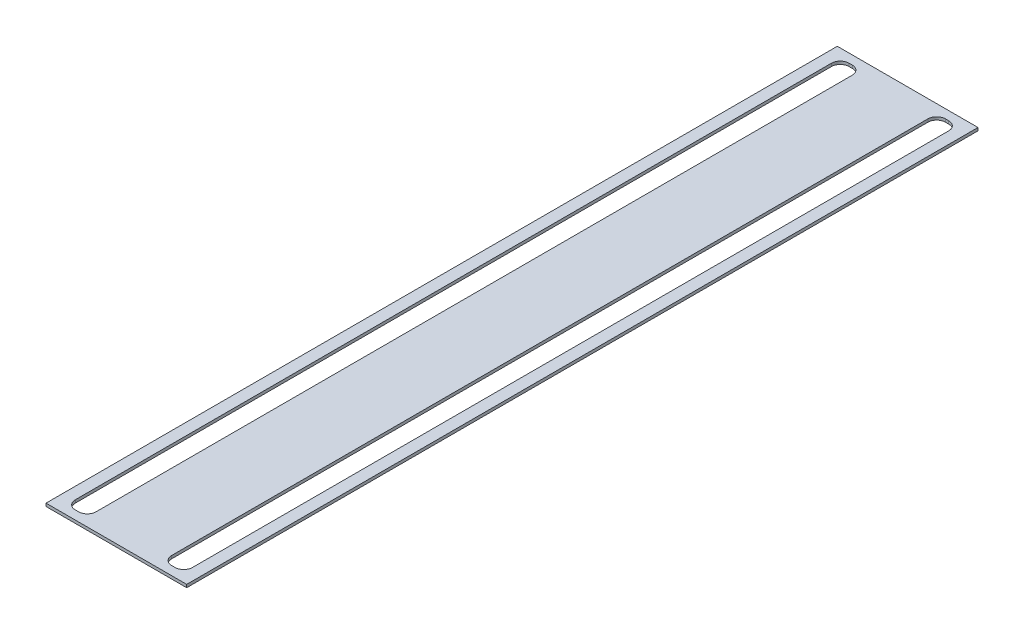
ISO-10303-21;
HEADER;
FILE_DESCRIPTION(('STEP AP214'),'2;1');
FILE_NAME('part.step','',(''),(''),'','','');
FILE_SCHEMA(('AUTOMOTIVE_DESIGN { 1 0 10303 214 1 1 1 1 }'));
ENDSEC;
DATA;
#1=APPLICATION_CONTEXT('core data for automotive mechanical design processes');
#2=APPLICATION_PROTOCOL_DEFINITION('international standard','automotive_design',2000,#1);
#3=PRODUCT_CONTEXT('',#1,'mechanical');
#4=PRODUCT('Part','Part','',(#3));
#5=PRODUCT_RELATED_PRODUCT_CATEGORY('part','',(#4));
#6=PRODUCT_DEFINITION_FORMATION('','',#4);
#7=PRODUCT_DEFINITION_CONTEXT('part definition',#1,'design');
#8=PRODUCT_DEFINITION('design','',#6,#7);
#9=PRODUCT_DEFINITION_SHAPE('','',#8);
#10=(LENGTH_UNIT() NAMED_UNIT(*) SI_UNIT(.MILLI.,.METRE.));
#11=(NAMED_UNIT(*) PLANE_ANGLE_UNIT() SI_UNIT($,.RADIAN.));
#12=(NAMED_UNIT(*) SI_UNIT($,.STERADIAN.) SOLID_ANGLE_UNIT());
#13=UNCERTAINTY_MEASURE_WITH_UNIT(LENGTH_MEASURE(1.E-05),#10,'distance_accuracy_value','');
#14=(GEOMETRIC_REPRESENTATION_CONTEXT(3) GLOBAL_UNCERTAINTY_ASSIGNED_CONTEXT((#13)) GLOBAL_UNIT_ASSIGNED_CONTEXT((#10,
#11,#12)) REPRESENTATION_CONTEXT('',''));
#15=CARTESIAN_POINT('',(0.,0.,0.));
#16=DIRECTION('',(0.,0.,1.));
#17=DIRECTION('',(1.,0.,0.));
#18=AXIS2_PLACEMENT_3D('',#15,#16,#17);
#19=CARTESIAN_POINT('',(0.,1.,0.));
#20=DIRECTION('',(0.,1.,0.));
#21=DIRECTION('',(0.,0.,1.));
#22=AXIS2_PLACEMENT_3D('',#19,#20,#21);
#23=PLANE('',#22);
#24=DIRECTION('',(0.,0.,1.));
#25=VECTOR('',#24,1.);
#26=CARTESIAN_POINT('',(-24.,1.,135.));
#27=LINE('',#26,#25);
#28=CARTESIAN_POINT('',(-24.,1.,-135.));
#29=VERTEX_POINT('',#28);
#30=CARTESIAN_POINT('',(-24.,1.,135.));
#31=VERTEX_POINT('',#30);
#32=EDGE_CURVE('E189',#29,#31,#27,.T.);
#33=ORIENTED_EDGE('',*,*,#32,.T.);
#34=DIRECTION('',(1.,0.,0.));
#35=VECTOR('',#34,1.);
#36=CARTESIAN_POINT('',(24.,1.,135.));
#37=LINE('',#36,#35);
#38=CARTESIAN_POINT('',(24.,1.,135.));
#39=VERTEX_POINT('',#38);
#40=EDGE_CURVE('E177',#31,#39,#37,.T.);
#41=ORIENTED_EDGE('',*,*,#40,.T.);
#42=DIRECTION('',(0.,0.,-1.));
#43=VECTOR('',#42,1.);
#44=CARTESIAN_POINT('',(24.,1.,135.));
#45=LINE('',#44,#43);
#46=CARTESIAN_POINT('',(24.,1.,-135.));
#47=VERTEX_POINT('',#46);
#48=EDGE_CURVE('E188',#39,#47,#45,.T.);
#49=ORIENTED_EDGE('',*,*,#48,.T.);
#50=DIRECTION('',(-1.,0.,0.));
#51=VECTOR('',#50,1.);
#52=CARTESIAN_POINT('',(24.,1.,-135.));
#53=LINE('',#52,#51);
#54=EDGE_CURVE('E193',#47,#29,#53,.T.);
#55=ORIENTED_EDGE('',*,*,#54,.T.);
#56=EDGE_LOOP('',(#33,#41,#49,#55));
#57=FACE_BOUND('',#56,.T.);
#58=DIRECTION('',(1.,0.,0.));
#59=VECTOR('',#58,1.);
#60=CARTESIAN_POINT('',(-20.,1.,132.));
#61=LINE('',#60,#59);
#62=CARTESIAN_POINT('',(-17.,1.,132.));
#63=VERTEX_POINT('',#62);
#64=CARTESIAN_POINT('',(-15.9,1.,132.));
#65=VERTEX_POINT('',#64);
#66=EDGE_CURVE('E364',#63,#65,#61,.T.);
#67=ORIENTED_EDGE('',*,*,#66,.F.);
#68=CARTESIAN_POINT('',(-17.,1.,129.));
#69=DIRECTION('',(0.,1.,0.));
#70=DIRECTION('',(0.,0.,1.));
#71=AXIS2_PLACEMENT_3D('',#68,#69,#70);
#72=CIRCLE('',#71,3.);
#73=CARTESIAN_POINT('',(-20.,1.,129.));
#74=VERTEX_POINT('',#73);
#75=EDGE_CURVE('E54',#63,#74,#72,.F.);
#76=ORIENTED_EDGE('',*,*,#75,.T.);
#77=DIRECTION('',(0.,0.,1.));
#78=VECTOR('',#77,1.);
#79=CARTESIAN_POINT('',(-20.,1.,-132.));
#80=LINE('',#79,#78);
#81=CARTESIAN_POINT('',(-20.,1.,-129.));
#82=VERTEX_POINT('',#81);
#83=EDGE_CURVE('E361',#82,#74,#80,.T.);
#84=ORIENTED_EDGE('',*,*,#83,.F.);
#85=CARTESIAN_POINT('',(-17.,1.,-129.));
#86=DIRECTION('',(0.,1.,0.));
#87=DIRECTION('',(0.,0.,1.));
#88=AXIS2_PLACEMENT_3D('',#85,#86,#87);
#89=CIRCLE('',#88,3.);
#90=CARTESIAN_POINT('',(-17.,1.,-132.));
#91=VERTEX_POINT('',#90);
#92=EDGE_CURVE('E300',#82,#91,#89,.F.);
#93=ORIENTED_EDGE('',*,*,#92,.T.);
#94=DIRECTION('',(-1.,0.,0.));
#95=VECTOR('',#94,1.);
#96=CARTESIAN_POINT('',(-20.,1.,-132.));
#97=LINE('',#96,#95);
#98=CARTESIAN_POINT('',(-15.9,1.,-132.));
#99=VERTEX_POINT('',#98);
#100=EDGE_CURVE('E373',#99,#91,#97,.T.);
#101=ORIENTED_EDGE('',*,*,#100,.F.);
#102=CARTESIAN_POINT('',(-15.9,1.,-129.));
#103=DIRECTION('',(0.,1.,0.));
#104=DIRECTION('',(0.,0.,1.));
#105=AXIS2_PLACEMENT_3D('',#102,#103,#104);
#106=CIRCLE('',#105,3.);
#107=CARTESIAN_POINT('',(-12.9,1.,-129.));
#108=VERTEX_POINT('',#107);
#109=EDGE_CURVE('E294',#99,#108,#106,.F.);
#110=ORIENTED_EDGE('',*,*,#109,.T.);
#111=DIRECTION('',(0.,0.,-1.));
#112=VECTOR('',#111,1.);
#113=CARTESIAN_POINT('',(-12.9,1.,-132.));
#114=LINE('',#113,#112);
#115=CARTESIAN_POINT('',(-12.9,1.,129.));
#116=VERTEX_POINT('',#115);
#117=EDGE_CURVE('E369',#116,#108,#114,.T.);
#118=ORIENTED_EDGE('',*,*,#117,.F.);
#119=CARTESIAN_POINT('',(-15.9,1.,129.));
#120=DIRECTION('',(0.,1.,0.));
#121=DIRECTION('',(0.,0.,1.));
#122=AXIS2_PLACEMENT_3D('',#119,#120,#121);
#123=CIRCLE('',#122,3.);
#124=EDGE_CURVE('E288',#116,#65,#123,.F.);
#125=ORIENTED_EDGE('',*,*,#124,.T.);
#126=EDGE_LOOP('',(#67,#76,#84,#93,#101,#110,#118,#125));
#127=FACE_BOUND('',#126,.T.);
#128=DIRECTION('',(-1.,0.,0.));
#129=VECTOR('',#128,1.);
#130=CARTESIAN_POINT('',(20.,1.,-132.));
#131=LINE('',#130,#129);
#132=CARTESIAN_POINT('',(17.,1.,-132.));
#133=VERTEX_POINT('',#132);
#134=CARTESIAN_POINT('',(15.9,1.,-132.));
#135=VERTEX_POINT('',#134);
#136=EDGE_CURVE('E336',#133,#135,#131,.T.);
#137=ORIENTED_EDGE('',*,*,#136,.F.);
#138=CARTESIAN_POINT('',(17.,1.,-129.));
#139=DIRECTION('',(0.,1.,0.));
#140=DIRECTION('',(0.,0.,1.));
#141=AXIS2_PLACEMENT_3D('',#138,#139,#140);
#142=CIRCLE('',#141,3.);
#143=CARTESIAN_POINT('',(20.,1.,-129.));
#144=VERTEX_POINT('',#143);
#145=EDGE_CURVE('E11',#133,#144,#142,.F.);
#146=ORIENTED_EDGE('',*,*,#145,.T.);
#147=DIRECTION('',(0.,0.,-1.));
#148=VECTOR('',#147,1.);
#149=CARTESIAN_POINT('',(20.,1.,-132.));
#150=LINE('',#149,#148);
#151=CARTESIAN_POINT('',(20.,1.,129.));
#152=VERTEX_POINT('',#151);
#153=EDGE_CURVE('E334',#152,#144,#150,.T.);
#154=ORIENTED_EDGE('',*,*,#153,.F.);
#155=CARTESIAN_POINT('',(17.,1.,129.));
#156=DIRECTION('',(0.,1.,0.));
#157=DIRECTION('',(0.,0.,1.));
#158=AXIS2_PLACEMENT_3D('',#155,#156,#157);
#159=CIRCLE('',#158,3.);
#160=CARTESIAN_POINT('',(17.,1.,132.));
#161=VERTEX_POINT('',#160);
#162=EDGE_CURVE('E282',#152,#161,#159,.F.);
#163=ORIENTED_EDGE('',*,*,#162,.T.);
#164=DIRECTION('',(1.,0.,0.));
#165=VECTOR('',#164,1.);
#166=CARTESIAN_POINT('',(20.,1.,132.));
#167=LINE('',#166,#165);
#168=CARTESIAN_POINT('',(15.9,1.,132.));
#169=VERTEX_POINT('',#168);
#170=EDGE_CURVE('E352',#169,#161,#167,.T.);
#171=ORIENTED_EDGE('',*,*,#170,.F.);
#172=CARTESIAN_POINT('',(15.9,1.,129.));
#173=DIRECTION('',(0.,1.,0.));
#174=DIRECTION('',(0.,0.,1.));
#175=AXIS2_PLACEMENT_3D('',#172,#173,#174);
#176=CIRCLE('',#175,3.);
#177=CARTESIAN_POINT('',(12.9,1.,129.));
#178=VERTEX_POINT('',#177);
#179=EDGE_CURVE('E276',#169,#178,#176,.F.);
#180=ORIENTED_EDGE('',*,*,#179,.T.);
#181=DIRECTION('',(0.,0.,1.));
#182=VECTOR('',#181,1.);
#183=CARTESIAN_POINT('',(12.9,1.,-132.));
#184=LINE('',#183,#182);
#185=CARTESIAN_POINT('',(12.9,1.,-129.));
#186=VERTEX_POINT('',#185);
#187=EDGE_CURVE('E344',#186,#178,#184,.T.);
#188=ORIENTED_EDGE('',*,*,#187,.F.);
#189=CARTESIAN_POINT('',(15.9,1.,-129.));
#190=DIRECTION('',(0.,1.,0.));
#191=DIRECTION('',(0.,0.,1.));
#192=AXIS2_PLACEMENT_3D('',#189,#190,#191);
#193=CIRCLE('',#192,3.);
#194=EDGE_CURVE('E270',#186,#135,#193,.F.);
#195=ORIENTED_EDGE('',*,*,#194,.T.);
#196=EDGE_LOOP('',(#137,#146,#154,#163,#171,#180,#188,#195));
#197=FACE_BOUND('',#196,.T.);
#198=ADVANCED_FACE('F38',(#57,#127,#197),#23,.T.);
#199=CARTESIAN_POINT('',(0.,0.,0.));
#200=DIRECTION('',(0.,1.,0.));
#201=DIRECTION('',(0.,0.,1.));
#202=AXIS2_PLACEMENT_3D('',#199,#200,#201);
#203=PLANE('',#202);
#204=DIRECTION('',(-1.,0.,0.));
#205=VECTOR('',#204,1.);
#206=CARTESIAN_POINT('',(-20.,0.,-132.));
#207=LINE('',#206,#205);
#208=CARTESIAN_POINT('',(-15.9,0.,-132.));
#209=VERTEX_POINT('',#208);
#210=CARTESIAN_POINT('',(-17.,0.,-132.));
#211=VERTEX_POINT('',#210);
#212=EDGE_CURVE('E365',#209,#211,#207,.T.);
#213=ORIENTED_EDGE('',*,*,#212,.T.);
#214=CARTESIAN_POINT('',(-17.,0.,-129.));
#215=DIRECTION('',(0.,1.,0.));
#216=DIRECTION('',(0.,0.,1.));
#217=AXIS2_PLACEMENT_3D('',#214,#215,#216);
#218=CIRCLE('',#217,3.);
#219=CARTESIAN_POINT('',(-20.,0.,-129.));
#220=VERTEX_POINT('',#219);
#221=EDGE_CURVE('E297',#211,#220,#218,.T.);
#222=ORIENTED_EDGE('',*,*,#221,.T.);
#223=DIRECTION('',(0.,0.,1.));
#224=VECTOR('',#223,1.);
#225=CARTESIAN_POINT('',(-20.,0.,-132.));
#226=LINE('',#225,#224);
#227=CARTESIAN_POINT('',(-20.,0.,129.));
#228=VERTEX_POINT('',#227);
#229=EDGE_CURVE('E356',#220,#228,#226,.T.);
#230=ORIENTED_EDGE('',*,*,#229,.T.);
#231=CARTESIAN_POINT('',(-17.,0.,129.));
#232=DIRECTION('',(0.,1.,0.));
#233=DIRECTION('',(0.,0.,1.));
#234=AXIS2_PLACEMENT_3D('',#231,#232,#233);
#235=CIRCLE('',#234,3.);
#236=CARTESIAN_POINT('',(-17.,0.,132.));
#237=VERTEX_POINT('',#236);
#238=EDGE_CURVE('E303',#228,#237,#235,.T.);
#239=ORIENTED_EDGE('',*,*,#238,.T.);
#240=DIRECTION('',(1.,0.,0.));
#241=VECTOR('',#240,1.);
#242=CARTESIAN_POINT('',(-20.,0.,132.));
#243=LINE('',#242,#241);
#244=CARTESIAN_POINT('',(-15.9,0.,132.));
#245=VERTEX_POINT('',#244);
#246=EDGE_CURVE('E380',#237,#245,#243,.T.);
#247=ORIENTED_EDGE('',*,*,#246,.T.);
#248=CARTESIAN_POINT('',(-15.9,0.,129.));
#249=DIRECTION('',(0.,1.,0.));
#250=DIRECTION('',(0.,0.,1.));
#251=AXIS2_PLACEMENT_3D('',#248,#249,#250);
#252=CIRCLE('',#251,3.);
#253=CARTESIAN_POINT('',(-12.9,0.,129.));
#254=VERTEX_POINT('',#253);
#255=EDGE_CURVE('E285',#245,#254,#252,.T.);
#256=ORIENTED_EDGE('',*,*,#255,.T.);
#257=DIRECTION('',(0.,0.,-1.));
#258=VECTOR('',#257,1.);
#259=CARTESIAN_POINT('',(-12.9,0.,-132.));
#260=LINE('',#259,#258);
#261=CARTESIAN_POINT('',(-12.9,0.,-129.));
#262=VERTEX_POINT('',#261);
#263=EDGE_CURVE('E384',#254,#262,#260,.T.);
#264=ORIENTED_EDGE('',*,*,#263,.T.);
#265=CARTESIAN_POINT('',(-15.9,0.,-129.));
#266=DIRECTION('',(0.,1.,0.));
#267=DIRECTION('',(0.,0.,1.));
#268=AXIS2_PLACEMENT_3D('',#265,#266,#267);
#269=CIRCLE('',#268,3.);
#270=EDGE_CURVE('E291',#262,#209,#269,.T.);
#271=ORIENTED_EDGE('',*,*,#270,.T.);
#272=EDGE_LOOP('',(#213,#222,#230,#239,#247,#256,#264,#271));
#273=FACE_BOUND('',#272,.T.);
#274=DIRECTION('',(0.,0.,1.));
#275=VECTOR('',#274,1.);
#276=CARTESIAN_POINT('',(-24.,0.,135.));
#277=LINE('',#276,#275);
#278=CARTESIAN_POINT('',(-24.,0.,-135.));
#279=VERTEX_POINT('',#278);
#280=CARTESIAN_POINT('',(-24.,0.,135.));
#281=VERTEX_POINT('',#280);
#282=EDGE_CURVE('E202',#279,#281,#277,.T.);
#283=ORIENTED_EDGE('',*,*,#282,.F.);
#284=DIRECTION('',(-1.,0.,0.));
#285=VECTOR('',#284,1.);
#286=CARTESIAN_POINT('',(24.,0.,-135.));
#287=LINE('',#286,#285);
#288=CARTESIAN_POINT('',(24.,0.,-135.));
#289=VERTEX_POINT('',#288);
#290=EDGE_CURVE('E198',#289,#279,#287,.T.);
#291=ORIENTED_EDGE('',*,*,#290,.F.);
#292=DIRECTION('',(0.,0.,-1.));
#293=VECTOR('',#292,1.);
#294=CARTESIAN_POINT('',(24.,0.,135.));
#295=LINE('',#294,#293);
#296=CARTESIAN_POINT('',(24.,0.,135.));
#297=VERTEX_POINT('',#296);
#298=EDGE_CURVE('E400',#297,#289,#295,.T.);
#299=ORIENTED_EDGE('',*,*,#298,.F.);
#300=DIRECTION('',(1.,0.,0.));
#301=VECTOR('',#300,1.);
#302=CARTESIAN_POINT('',(24.,0.,135.));
#303=LINE('',#302,#301);
#304=EDGE_CURVE('E397',#281,#297,#303,.T.);
#305=ORIENTED_EDGE('',*,*,#304,.F.);
#306=EDGE_LOOP('',(#283,#291,#299,#305));
#307=FACE_BOUND('',#306,.T.);
#308=DIRECTION('',(1.,0.,0.));
#309=VECTOR('',#308,1.);
#310=CARTESIAN_POINT('',(20.,0.,132.));
#311=LINE('',#310,#309);
#312=CARTESIAN_POINT('',(15.9,0.,132.));
#313=VERTEX_POINT('',#312);
#314=CARTESIAN_POINT('',(17.,0.,132.));
#315=VERTEX_POINT('',#314);
#316=EDGE_CURVE('E341',#313,#315,#311,.T.);
#317=ORIENTED_EDGE('',*,*,#316,.T.);
#318=CARTESIAN_POINT('',(17.,0.,129.));
#319=DIRECTION('',(0.,1.,0.));
#320=DIRECTION('',(0.,0.,1.));
#321=AXIS2_PLACEMENT_3D('',#318,#319,#320);
#322=CIRCLE('',#321,3.);
#323=CARTESIAN_POINT('',(20.,0.,129.));
#324=VERTEX_POINT('',#323);
#325=EDGE_CURVE('E279',#315,#324,#322,.T.);
#326=ORIENTED_EDGE('',*,*,#325,.T.);
#327=DIRECTION('',(0.,0.,-1.));
#328=VECTOR('',#327,1.);
#329=CARTESIAN_POINT('',(20.,0.,-132.));
#330=LINE('',#329,#328);
#331=CARTESIAN_POINT('',(20.,0.,-129.));
#332=VERTEX_POINT('',#331);
#333=EDGE_CURVE('E318',#324,#332,#330,.T.);
#334=ORIENTED_EDGE('',*,*,#333,.T.);
#335=CARTESIAN_POINT('',(17.,0.,-129.));
#336=DIRECTION('',(0.,1.,0.));
#337=DIRECTION('',(0.,0.,1.));
#338=AXIS2_PLACEMENT_3D('',#335,#336,#337);
#339=CIRCLE('',#338,3.);
#340=CARTESIAN_POINT('',(17.,0.,-132.));
#341=VERTEX_POINT('',#340);
#342=EDGE_CURVE('E47',#332,#341,#339,.T.);
#343=ORIENTED_EDGE('',*,*,#342,.T.);
#344=DIRECTION('',(-1.,0.,0.));
#345=VECTOR('',#344,1.);
#346=CARTESIAN_POINT('',(20.,0.,-132.));
#347=LINE('',#346,#345);
#348=CARTESIAN_POINT('',(15.9,0.,-132.));
#349=VERTEX_POINT('',#348);
#350=EDGE_CURVE('E316',#341,#349,#347,.T.);
#351=ORIENTED_EDGE('',*,*,#350,.T.);
#352=CARTESIAN_POINT('',(15.9,0.,-129.));
#353=DIRECTION('',(0.,1.,0.));
#354=DIRECTION('',(0.,0.,1.));
#355=AXIS2_PLACEMENT_3D('',#352,#353,#354);
#356=CIRCLE('',#355,3.);
#357=CARTESIAN_POINT('',(12.9,0.,-129.));
#358=VERTEX_POINT('',#357);
#359=EDGE_CURVE('E267',#349,#358,#356,.T.);
#360=ORIENTED_EDGE('',*,*,#359,.T.);
#361=DIRECTION('',(0.,0.,1.));
#362=VECTOR('',#361,1.);
#363=CARTESIAN_POINT('',(12.9,0.,-132.));
#364=LINE('',#363,#362);
#365=CARTESIAN_POINT('',(12.9,0.,129.));
#366=VERTEX_POINT('',#365);
#367=EDGE_CURVE('E328',#358,#366,#364,.T.);
#368=ORIENTED_EDGE('',*,*,#367,.T.);
#369=CARTESIAN_POINT('',(15.9,0.,129.));
#370=DIRECTION('',(0.,1.,0.));
#371=DIRECTION('',(0.,0.,1.));
#372=AXIS2_PLACEMENT_3D('',#369,#370,#371);
#373=CIRCLE('',#372,3.);
#374=EDGE_CURVE('E273',#366,#313,#373,.T.);
#375=ORIENTED_EDGE('',*,*,#374,.T.);
#376=EDGE_LOOP('',(#317,#326,#334,#343,#351,#360,#368,#375));
#377=FACE_BOUND('',#376,.T.);
#378=ADVANCED_FACE('F315',(#273,#307,#377),#203,.F.);
#379=CARTESIAN_POINT('',(-24.,1.,135.));
#380=DIRECTION('',(1.,0.,0.));
#381=DIRECTION('',(0.,0.,-1.));
#382=AXIS2_PLACEMENT_3D('',#379,#380,#381);
#383=PLANE('',#382);
#384=ORIENTED_EDGE('',*,*,#282,.T.);
#385=DIRECTION('',(0.,-1.,0.));
#386=VECTOR('',#385,1.);
#387=CARTESIAN_POINT('',(-24.,1.,135.));
#388=LINE('',#387,#386);
#389=EDGE_CURVE('E181',#31,#281,#388,.T.);
#390=ORIENTED_EDGE('',*,*,#389,.F.);
#391=ORIENTED_EDGE('',*,*,#32,.F.);
#392=DIRECTION('',(0.,-1.,0.));
#393=VECTOR('',#392,1.);
#394=CARTESIAN_POINT('',(-24.,1.,-135.));
#395=LINE('',#394,#393);
#396=EDGE_CURVE('E394',#29,#279,#395,.T.);
#397=ORIENTED_EDGE('',*,*,#396,.T.);
#398=EDGE_LOOP('',(#384,#390,#391,#397));
#399=FACE_BOUND('',#398,.T.);
#400=ADVANCED_FACE('F200',(#399),#383,.F.);
#401=CARTESIAN_POINT('',(24.,1.,135.));
#402=DIRECTION('',(0.,0.,-1.));
#403=DIRECTION('',(-1.,0.,0.));
#404=AXIS2_PLACEMENT_3D('',#401,#402,#403);
#405=PLANE('',#404);
#406=ORIENTED_EDGE('',*,*,#304,.T.);
#407=DIRECTION('',(0.,-1.,0.));
#408=VECTOR('',#407,1.);
#409=CARTESIAN_POINT('',(24.,1.,135.));
#410=LINE('',#409,#408);
#411=EDGE_CURVE('E184',#39,#297,#410,.T.);
#412=ORIENTED_EDGE('',*,*,#411,.F.);
#413=ORIENTED_EDGE('',*,*,#40,.F.);
#414=ORIENTED_EDGE('',*,*,#389,.T.);
#415=EDGE_LOOP('',(#406,#412,#413,#414));
#416=FACE_BOUND('',#415,.T.);
#417=ADVANCED_FACE('F179',(#416),#405,.F.);
#418=CARTESIAN_POINT('',(24.,1.,135.));
#419=DIRECTION('',(-1.,0.,0.));
#420=DIRECTION('',(0.,0.,1.));
#421=AXIS2_PLACEMENT_3D('',#418,#419,#420);
#422=PLANE('',#421);
#423=ORIENTED_EDGE('',*,*,#298,.T.);
#424=DIRECTION('',(0.,-1.,0.));
#425=VECTOR('',#424,1.);
#426=CARTESIAN_POINT('',(24.,1.,-135.));
#427=LINE('',#426,#425);
#428=EDGE_CURVE('E212',#47,#289,#427,.T.);
#429=ORIENTED_EDGE('',*,*,#428,.F.);
#430=ORIENTED_EDGE('',*,*,#48,.F.);
#431=ORIENTED_EDGE('',*,*,#411,.T.);
#432=EDGE_LOOP('',(#423,#429,#430,#431));
#433=FACE_BOUND('',#432,.T.);
#434=ADVANCED_FACE('F413',(#433),#422,.F.);
#435=CARTESIAN_POINT('',(24.,1.,-135.));
#436=DIRECTION('',(0.,0.,1.));
#437=DIRECTION('',(1.,0.,0.));
#438=AXIS2_PLACEMENT_3D('',#435,#436,#437);
#439=PLANE('',#438);
#440=ORIENTED_EDGE('',*,*,#290,.T.);
#441=ORIENTED_EDGE('',*,*,#396,.F.);
#442=ORIENTED_EDGE('',*,*,#54,.F.);
#443=ORIENTED_EDGE('',*,*,#428,.T.);
#444=EDGE_LOOP('',(#440,#441,#442,#443));
#445=FACE_BOUND('',#444,.T.);
#446=ADVANCED_FACE('F409',(#445),#439,.F.);
#447=CARTESIAN_POINT('',(-20.,1.,-132.));
#448=DIRECTION('',(1.,0.,0.));
#449=DIRECTION('',(0.,0.,-1.));
#450=AXIS2_PLACEMENT_3D('',#447,#448,#449);
#451=PLANE('',#450);
#452=ORIENTED_EDGE('',*,*,#229,.F.);
#453=DIRECTION('',(0.,-1.,0.));
#454=VECTOR('',#453,1.);
#455=CARTESIAN_POINT('',(-20.,1.,-129.));
#456=LINE('',#455,#454);
#457=EDGE_CURVE('E61',#220,#82,#456,.F.);
#458=ORIENTED_EDGE('',*,*,#457,.T.);
#459=ORIENTED_EDGE('',*,*,#83,.T.);
#460=DIRECTION('',(0.,-1.,0.));
#461=VECTOR('',#460,1.);
#462=CARTESIAN_POINT('',(-20.,0.,129.));
#463=LINE('',#462,#461);
#464=EDGE_CURVE('E261',#74,#228,#463,.T.);
#465=ORIENTED_EDGE('',*,*,#464,.T.);
#466=EDGE_LOOP('',(#452,#458,#459,#465));
#467=FACE_BOUND('',#466,.T.);
#468=ADVANCED_FACE('F420',(#467),#451,.T.);
#469=CARTESIAN_POINT('',(-20.,1.,132.));
#470=DIRECTION('',(0.,0.,-1.));
#471=DIRECTION('',(-1.,0.,0.));
#472=AXIS2_PLACEMENT_3D('',#469,#470,#471);
#473=PLANE('',#472);
#474=ORIENTED_EDGE('',*,*,#66,.T.);
#475=DIRECTION('',(0.,-1.,0.));
#476=VECTOR('',#475,1.);
#477=CARTESIAN_POINT('',(-15.9,0.,132.));
#478=LINE('',#477,#476);
#479=EDGE_CURVE('E243',#65,#245,#478,.T.);
#480=ORIENTED_EDGE('',*,*,#479,.T.);
#481=ORIENTED_EDGE('',*,*,#246,.F.);
#482=DIRECTION('',(0.,-1.,0.));
#483=VECTOR('',#482,1.);
#484=CARTESIAN_POINT('',(-17.,1.,132.));
#485=LINE('',#484,#483);
#486=EDGE_CURVE('E240',#237,#63,#485,.F.);
#487=ORIENTED_EDGE('',*,*,#486,.T.);
#488=EDGE_LOOP('',(#474,#480,#481,#487));
#489=FACE_BOUND('',#488,.T.);
#490=ADVANCED_FACE('F433',(#489),#473,.T.);
#491=CARTESIAN_POINT('',(-12.9,1.,-132.));
#492=DIRECTION('',(-1.,0.,0.));
#493=DIRECTION('',(0.,0.,1.));
#494=AXIS2_PLACEMENT_3D('',#491,#492,#493);
#495=PLANE('',#494);
#496=ORIENTED_EDGE('',*,*,#263,.F.);
#497=DIRECTION('',(0.,-1.,0.));
#498=VECTOR('',#497,1.);
#499=CARTESIAN_POINT('',(-12.9,1.,129.));
#500=LINE('',#499,#498);
#501=EDGE_CURVE('E251',#254,#116,#500,.F.);
#502=ORIENTED_EDGE('',*,*,#501,.T.);
#503=ORIENTED_EDGE('',*,*,#117,.T.);
#504=DIRECTION('',(0.,-1.,0.));
#505=VECTOR('',#504,1.);
#506=CARTESIAN_POINT('',(-12.9,0.,-129.));
#507=LINE('',#506,#505);
#508=EDGE_CURVE('E247',#108,#262,#507,.T.);
#509=ORIENTED_EDGE('',*,*,#508,.T.);
#510=EDGE_LOOP('',(#496,#502,#503,#509));
#511=FACE_BOUND('',#510,.T.);
#512=ADVANCED_FACE('F436',(#511),#495,.T.);
#513=CARTESIAN_POINT('',(-20.,1.,-132.));
#514=DIRECTION('',(0.,0.,1.));
#515=DIRECTION('',(1.,0.,0.));
#516=AXIS2_PLACEMENT_3D('',#513,#514,#515);
#517=PLANE('',#516);
#518=ORIENTED_EDGE('',*,*,#212,.F.);
#519=DIRECTION('',(0.,-1.,0.));
#520=VECTOR('',#519,1.);
#521=CARTESIAN_POINT('',(-15.9,1.,-132.));
#522=LINE('',#521,#520);
#523=EDGE_CURVE('E258',#209,#99,#522,.F.);
#524=ORIENTED_EDGE('',*,*,#523,.T.);
#525=ORIENTED_EDGE('',*,*,#100,.T.);
#526=DIRECTION('',(0.,-1.,0.));
#527=VECTOR('',#526,1.);
#528=CARTESIAN_POINT('',(-17.,0.,-132.));
#529=LINE('',#528,#527);
#530=EDGE_CURVE('E254',#91,#211,#529,.T.);
#531=ORIENTED_EDGE('',*,*,#530,.T.);
#532=EDGE_LOOP('',(#518,#524,#525,#531));
#533=FACE_BOUND('',#532,.T.);
#534=ADVANCED_FACE('F440',(#533),#517,.T.);
#535=CARTESIAN_POINT('',(20.,1.,-132.));
#536=DIRECTION('',(-1.,0.,0.));
#537=DIRECTION('',(0.,0.,1.));
#538=AXIS2_PLACEMENT_3D('',#535,#536,#537);
#539=PLANE('',#538);
#540=ORIENTED_EDGE('',*,*,#333,.F.);
#541=DIRECTION('',(0.,-1.,0.));
#542=VECTOR('',#541,1.);
#543=CARTESIAN_POINT('',(20.,1.,129.));
#544=LINE('',#543,#542);
#545=EDGE_CURVE('E237',#324,#152,#544,.F.);
#546=ORIENTED_EDGE('',*,*,#545,.T.);
#547=ORIENTED_EDGE('',*,*,#153,.T.);
#548=DIRECTION('',(0.,-1.,0.));
#549=VECTOR('',#548,1.);
#550=CARTESIAN_POINT('',(20.,0.,-129.));
#551=LINE('',#550,#549);
#552=EDGE_CURVE('E233',#144,#332,#551,.T.);
#553=ORIENTED_EDGE('',*,*,#552,.T.);
#554=EDGE_LOOP('',(#540,#546,#547,#553));
#555=FACE_BOUND('',#554,.T.);
#556=ADVANCED_FACE('F338',(#555),#539,.T.);
#557=CARTESIAN_POINT('',(20.,1.,-132.));
#558=DIRECTION('',(0.,0.,1.));
#559=DIRECTION('',(1.,0.,0.));
#560=AXIS2_PLACEMENT_3D('',#557,#558,#559);
#561=PLANE('',#560);
#562=ORIENTED_EDGE('',*,*,#136,.T.);
#563=DIRECTION('',(0.,-1.,0.));
#564=VECTOR('',#563,1.);
#565=CARTESIAN_POINT('',(15.9,0.,-132.));
#566=LINE('',#565,#564);
#567=EDGE_CURVE('E209',#135,#349,#566,.T.);
#568=ORIENTED_EDGE('',*,*,#567,.T.);
#569=ORIENTED_EDGE('',*,*,#350,.F.);
#570=DIRECTION('',(0.,-1.,0.));
#571=VECTOR('',#570,1.);
#572=CARTESIAN_POINT('',(17.,1.,-132.));
#573=LINE('',#572,#571);
#574=EDGE_CURVE('E204',#341,#133,#573,.F.);
#575=ORIENTED_EDGE('',*,*,#574,.T.);
#576=EDGE_LOOP('',(#562,#568,#569,#575));
#577=FACE_BOUND('',#576,.T.);
#578=ADVANCED_FACE('F324',(#577),#561,.T.);
#579=CARTESIAN_POINT('',(12.9,1.,-132.));
#580=DIRECTION('',(1.,0.,0.));
#581=DIRECTION('',(0.,0.,-1.));
#582=AXIS2_PLACEMENT_3D('',#579,#580,#581);
#583=PLANE('',#582);
#584=ORIENTED_EDGE('',*,*,#367,.F.);
#585=DIRECTION('',(0.,-1.,0.));
#586=VECTOR('',#585,1.);
#587=CARTESIAN_POINT('',(12.9,1.,-129.));
#588=LINE('',#587,#586);
#589=EDGE_CURVE('E223',#358,#186,#588,.F.);
#590=ORIENTED_EDGE('',*,*,#589,.T.);
#591=ORIENTED_EDGE('',*,*,#187,.T.);
#592=DIRECTION('',(0.,-1.,0.));
#593=VECTOR('',#592,1.);
#594=CARTESIAN_POINT('',(12.9,0.,129.));
#595=LINE('',#594,#593);
#596=EDGE_CURVE('E219',#178,#366,#595,.T.);
#597=ORIENTED_EDGE('',*,*,#596,.T.);
#598=EDGE_LOOP('',(#584,#590,#591,#597));
#599=FACE_BOUND('',#598,.T.);
#600=ADVANCED_FACE('F449',(#599),#583,.T.);
#601=CARTESIAN_POINT('',(20.,1.,132.));
#602=DIRECTION('',(0.,0.,-1.));
#603=DIRECTION('',(-1.,0.,0.));
#604=AXIS2_PLACEMENT_3D('',#601,#602,#603);
#605=PLANE('',#604);
#606=ORIENTED_EDGE('',*,*,#316,.F.);
#607=DIRECTION('',(0.,-1.,0.));
#608=VECTOR('',#607,1.);
#609=CARTESIAN_POINT('',(15.9,1.,132.));
#610=LINE('',#609,#608);
#611=EDGE_CURVE('E230',#313,#169,#610,.F.);
#612=ORIENTED_EDGE('',*,*,#611,.T.);
#613=ORIENTED_EDGE('',*,*,#170,.T.);
#614=DIRECTION('',(0.,-1.,0.));
#615=VECTOR('',#614,1.);
#616=CARTESIAN_POINT('',(17.,0.,132.));
#617=LINE('',#616,#615);
#618=EDGE_CURVE('E226',#161,#315,#617,.T.);
#619=ORIENTED_EDGE('',*,*,#618,.T.);
#620=EDGE_LOOP('',(#606,#612,#613,#619));
#621=FACE_BOUND('',#620,.T.);
#622=ADVANCED_FACE('F452',(#621),#605,.T.);
#623=CARTESIAN_POINT('',(15.9,1.,-129.));
#624=DIRECTION('',(0.,1.,0.));
#625=DIRECTION('',(0.,0.,1.));
#626=AXIS2_PLACEMENT_3D('',#623,#624,#625);
#627=CYLINDRICAL_SURFACE('',#626,3.);
#628=ORIENTED_EDGE('',*,*,#194,.F.);
#629=ORIENTED_EDGE('',*,*,#589,.F.);
#630=ORIENTED_EDGE('',*,*,#359,.F.);
#631=ORIENTED_EDGE('',*,*,#567,.F.);
#632=EDGE_LOOP('',(#628,#629,#630,#631));
#633=FACE_BOUND('',#632,.T.);
#634=ADVANCED_FACE('F455',(#633),#627,.F.);
#635=CARTESIAN_POINT('',(15.9,1.,129.));
#636=DIRECTION('',(0.,1.,0.));
#637=DIRECTION('',(0.,0.,1.));
#638=AXIS2_PLACEMENT_3D('',#635,#636,#637);
#639=CYLINDRICAL_SURFACE('',#638,3.);
#640=ORIENTED_EDGE('',*,*,#179,.F.);
#641=ORIENTED_EDGE('',*,*,#611,.F.);
#642=ORIENTED_EDGE('',*,*,#374,.F.);
#643=ORIENTED_EDGE('',*,*,#596,.F.);
#644=EDGE_LOOP('',(#640,#641,#642,#643));
#645=FACE_BOUND('',#644,.T.);
#646=ADVANCED_FACE('F460',(#645),#639,.F.);
#647=CARTESIAN_POINT('',(17.,1.,129.));
#648=DIRECTION('',(0.,1.,0.));
#649=DIRECTION('',(0.,0.,1.));
#650=AXIS2_PLACEMENT_3D('',#647,#648,#649);
#651=CYLINDRICAL_SURFACE('',#650,3.);
#652=ORIENTED_EDGE('',*,*,#162,.F.);
#653=ORIENTED_EDGE('',*,*,#545,.F.);
#654=ORIENTED_EDGE('',*,*,#325,.F.);
#655=ORIENTED_EDGE('',*,*,#618,.F.);
#656=EDGE_LOOP('',(#652,#653,#654,#655));
#657=FACE_BOUND('',#656,.T.);
#658=ADVANCED_FACE('F475',(#657),#651,.F.);
#659=CARTESIAN_POINT('',(-15.9,1.,129.));
#660=DIRECTION('',(0.,1.,0.));
#661=DIRECTION('',(0.,0.,1.));
#662=AXIS2_PLACEMENT_3D('',#659,#660,#661);
#663=CYLINDRICAL_SURFACE('',#662,3.);
#664=ORIENTED_EDGE('',*,*,#124,.F.);
#665=ORIENTED_EDGE('',*,*,#501,.F.);
#666=ORIENTED_EDGE('',*,*,#255,.F.);
#667=ORIENTED_EDGE('',*,*,#479,.F.);
#668=EDGE_LOOP('',(#664,#665,#666,#667));
#669=FACE_BOUND('',#668,.T.);
#670=ADVANCED_FACE('F477',(#669),#663,.F.);
#671=CARTESIAN_POINT('',(-15.9,1.,-129.));
#672=DIRECTION('',(0.,1.,0.));
#673=DIRECTION('',(0.,0.,1.));
#674=AXIS2_PLACEMENT_3D('',#671,#672,#673);
#675=CYLINDRICAL_SURFACE('',#674,3.);
#676=ORIENTED_EDGE('',*,*,#109,.F.);
#677=ORIENTED_EDGE('',*,*,#523,.F.);
#678=ORIENTED_EDGE('',*,*,#270,.F.);
#679=ORIENTED_EDGE('',*,*,#508,.F.);
#680=EDGE_LOOP('',(#676,#677,#678,#679));
#681=FACE_BOUND('',#680,.T.);
#682=ADVANCED_FACE('F483',(#681),#675,.F.);
#683=CARTESIAN_POINT('',(-17.,1.,-129.));
#684=DIRECTION('',(0.,1.,0.));
#685=DIRECTION('',(0.,0.,1.));
#686=AXIS2_PLACEMENT_3D('',#683,#684,#685);
#687=CYLINDRICAL_SURFACE('',#686,3.);
#688=ORIENTED_EDGE('',*,*,#92,.F.);
#689=ORIENTED_EDGE('',*,*,#457,.F.);
#690=ORIENTED_EDGE('',*,*,#221,.F.);
#691=ORIENTED_EDGE('',*,*,#530,.F.);
#692=EDGE_LOOP('',(#688,#689,#690,#691));
#693=FACE_BOUND('',#692,.T.);
#694=ADVANCED_FACE('F490',(#693),#687,.F.);
#695=CARTESIAN_POINT('',(-17.,1.,129.));
#696=DIRECTION('',(0.,1.,0.));
#697=DIRECTION('',(0.,0.,1.));
#698=AXIS2_PLACEMENT_3D('',#695,#696,#697);
#699=CYLINDRICAL_SURFACE('',#698,3.);
#700=ORIENTED_EDGE('',*,*,#75,.F.);
#701=ORIENTED_EDGE('',*,*,#486,.F.);
#702=ORIENTED_EDGE('',*,*,#238,.F.);
#703=ORIENTED_EDGE('',*,*,#464,.F.);
#704=EDGE_LOOP('',(#700,#701,#702,#703));
#705=FACE_BOUND('',#704,.T.);
#706=ADVANCED_FACE('F493',(#705),#699,.F.);
#707=CARTESIAN_POINT('',(17.,1.,-129.));
#708=DIRECTION('',(0.,1.,0.));
#709=DIRECTION('',(0.,0.,1.));
#710=AXIS2_PLACEMENT_3D('',#707,#708,#709);
#711=CYLINDRICAL_SURFACE('',#710,3.);
#712=ORIENTED_EDGE('',*,*,#145,.F.);
#713=ORIENTED_EDGE('',*,*,#574,.F.);
#714=ORIENTED_EDGE('',*,*,#342,.F.);
#715=ORIENTED_EDGE('',*,*,#552,.F.);
#716=EDGE_LOOP('',(#712,#713,#714,#715));
#717=FACE_BOUND('',#716,.T.);
#718=ADVANCED_FACE('F40',(#717),#711,.F.);
#719=CLOSED_SHELL('',(#198,#378,#400,#417,#434,#446,#468,#490,#512,#534,#556,#578,#600,#622,
#634,#646,#658,#670,#682,#694,#706,#718));
#720=MANIFOLD_SOLID_BREP('B2',#719);
#721=ADVANCED_BREP_SHAPE_REPRESENTATION('',(#18,#720),#14);
#722=SHAPE_DEFINITION_REPRESENTATION(#9,#721);
ENDSEC;
END-ISO-10303-21;
